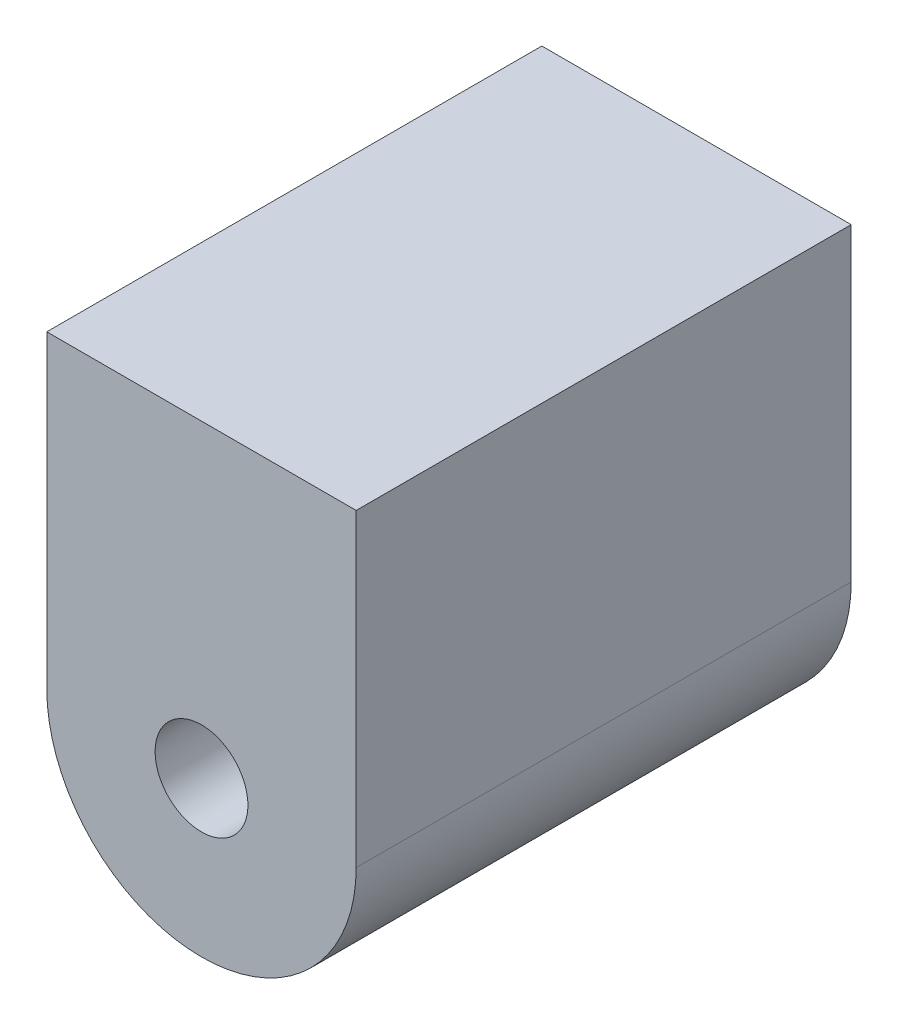
ISO-10303-21;
HEADER;
FILE_DESCRIPTION(('STEP AP214'),'2;1');
FILE_NAME('part.step','',(''),(''),'','','');
FILE_SCHEMA(('AUTOMOTIVE_DESIGN { 1 0 10303 214 1 1 1 1 }'));
ENDSEC;
DATA;
#1=APPLICATION_CONTEXT('core data for automotive mechanical design processes');
#2=APPLICATION_PROTOCOL_DEFINITION('international standard','automotive_design',2000,#1);
#3=PRODUCT_CONTEXT('',#1,'mechanical');
#4=PRODUCT('Part','Part','',(#3));
#5=PRODUCT_RELATED_PRODUCT_CATEGORY('part','',(#4));
#6=PRODUCT_DEFINITION_FORMATION('','',#4);
#7=PRODUCT_DEFINITION_CONTEXT('part definition',#1,'design');
#8=PRODUCT_DEFINITION('design','',#6,#7);
#9=PRODUCT_DEFINITION_SHAPE('','',#8);
#10=(LENGTH_UNIT() NAMED_UNIT(*) SI_UNIT(.MILLI.,.METRE.));
#11=(NAMED_UNIT(*) PLANE_ANGLE_UNIT() SI_UNIT($,.RADIAN.));
#12=(NAMED_UNIT(*) SI_UNIT($,.STERADIAN.) SOLID_ANGLE_UNIT());
#13=UNCERTAINTY_MEASURE_WITH_UNIT(LENGTH_MEASURE(1.E-05),#10,'distance_accuracy_value','');
#14=(GEOMETRIC_REPRESENTATION_CONTEXT(3) GLOBAL_UNCERTAINTY_ASSIGNED_CONTEXT((#13)) GLOBAL_UNIT_ASSIGNED_CONTEXT((#10,
#11,#12)) REPRESENTATION_CONTEXT('',''));
#15=CARTESIAN_POINT('',(0.,0.,0.));
#16=DIRECTION('',(0.,0.,1.));
#17=DIRECTION('',(1.,0.,0.));
#18=AXIS2_PLACEMENT_3D('',#15,#16,#17);
#19=CARTESIAN_POINT('',(31.,-30.,140.));
#20=DIRECTION('',(0.,0.,-1.));
#21=DIRECTION('',(-1.,0.,0.));
#22=AXIS2_PLACEMENT_3D('',#19,#20,#21);
#23=CYLINDRICAL_SURFACE('',#22,5.);
#24=CARTESIAN_POINT('',(31.,-30.,124.));
#25=DIRECTION('',(0.,0.,-1.));
#26=DIRECTION('',(-1.,0.,0.));
#27=AXIS2_PLACEMENT_3D('',#24,#25,#26);
#28=CIRCLE('',#27,5.);
#29=CARTESIAN_POINT('',(36.,-30.,124.));
#30=VERTEX_POINT('',#29);
#31=CARTESIAN_POINT('',(26.,-30.,124.));
#32=VERTEX_POINT('',#31);
#33=EDGE_CURVE('E106',#30,#32,#28,.T.);
#34=ORIENTED_EDGE('',*,*,#33,.F.);
#35=DIRECTION('',(0.,0.,-1.));
#36=VECTOR('',#35,1.);
#37=CARTESIAN_POINT('',(36.,-30.,140.));
#38=LINE('',#37,#36);
#39=CARTESIAN_POINT('',(36.,-30.,140.));
#40=VERTEX_POINT('',#39);
#41=EDGE_CURVE('E11',#40,#30,#38,.T.);
#42=ORIENTED_EDGE('',*,*,#41,.F.);
#43=CARTESIAN_POINT('',(31.,-30.,140.));
#44=DIRECTION('',(0.,0.,-1.));
#45=DIRECTION('',(-1.,0.,0.));
#46=AXIS2_PLACEMENT_3D('',#43,#44,#45);
#47=CIRCLE('',#46,5.);
#48=CARTESIAN_POINT('',(26.,-30.,140.));
#49=VERTEX_POINT('',#48);
#50=EDGE_CURVE('E99',#40,#49,#47,.T.);
#51=ORIENTED_EDGE('',*,*,#50,.T.);
#52=DIRECTION('',(0.,0.,-1.));
#53=VECTOR('',#52,1.);
#54=CARTESIAN_POINT('',(26.,-30.,140.));
#55=LINE('',#54,#53);
#56=EDGE_CURVE('E44',#49,#32,#55,.T.);
#57=ORIENTED_EDGE('',*,*,#56,.T.);
#58=EDGE_LOOP('',(#34,#42,#51,#57));
#59=FACE_BOUND('',#58,.T.);
#60=ADVANCED_FACE('F41',(#59),#23,.T.);
#61=CARTESIAN_POINT('',(36.,-20.,140.));
#62=DIRECTION('',(1.,0.,0.));
#63=DIRECTION('',(0.,0.,-1.));
#64=AXIS2_PLACEMENT_3D('',#61,#62,#63);
#65=PLANE('',#64);
#66=DIRECTION('',(0.,-1.,0.));
#67=VECTOR('',#66,1.);
#68=CARTESIAN_POINT('',(36.,-20.,124.));
#69=LINE('',#68,#67);
#70=CARTESIAN_POINT('',(36.,-20.,124.));
#71=VERTEX_POINT('',#70);
#72=EDGE_CURVE('E101',#71,#30,#69,.T.);
#73=ORIENTED_EDGE('',*,*,#72,.F.);
#74=DIRECTION('',(0.,0.,-1.));
#75=VECTOR('',#74,1.);
#76=CARTESIAN_POINT('',(36.,-20.,140.));
#77=LINE('',#76,#75);
#78=CARTESIAN_POINT('',(36.,-20.,140.));
#79=VERTEX_POINT('',#78);
#80=EDGE_CURVE('E50',#79,#71,#77,.T.);
#81=ORIENTED_EDGE('',*,*,#80,.F.);
#82=DIRECTION('',(0.,-1.,0.));
#83=VECTOR('',#82,1.);
#84=CARTESIAN_POINT('',(36.,-20.,140.));
#85=LINE('',#84,#83);
#86=EDGE_CURVE('E96',#79,#40,#85,.T.);
#87=ORIENTED_EDGE('',*,*,#86,.T.);
#88=ORIENTED_EDGE('',*,*,#41,.T.);
#89=EDGE_LOOP('',(#73,#81,#87,#88));
#90=FACE_BOUND('',#89,.T.);
#91=ADVANCED_FACE('F117',(#90),#65,.T.);
#92=CARTESIAN_POINT('',(36.,-20.,140.));
#93=DIRECTION('',(0.,1.,0.));
#94=DIRECTION('',(0.,0.,1.));
#95=AXIS2_PLACEMENT_3D('',#92,#93,#94);
#96=PLANE('',#95);
#97=DIRECTION('',(1.,0.,0.));
#98=VECTOR('',#97,1.);
#99=CARTESIAN_POINT('',(36.,-20.,124.));
#100=LINE('',#99,#98);
#101=CARTESIAN_POINT('',(26.,-20.,124.));
#102=VERTEX_POINT('',#101);
#103=EDGE_CURVE('E91',#102,#71,#100,.T.);
#104=ORIENTED_EDGE('',*,*,#103,.F.);
#105=DIRECTION('',(0.,0.,-1.));
#106=VECTOR('',#105,1.);
#107=CARTESIAN_POINT('',(26.,-20.,140.));
#108=LINE('',#107,#106);
#109=CARTESIAN_POINT('',(26.,-20.,140.));
#110=VERTEX_POINT('',#109);
#111=EDGE_CURVE('E86',#110,#102,#108,.T.);
#112=ORIENTED_EDGE('',*,*,#111,.F.);
#113=DIRECTION('',(1.,0.,0.));
#114=VECTOR('',#113,1.);
#115=CARTESIAN_POINT('',(36.,-20.,140.));
#116=LINE('',#115,#114);
#117=EDGE_CURVE('E89',#110,#79,#116,.T.);
#118=ORIENTED_EDGE('',*,*,#117,.T.);
#119=ORIENTED_EDGE('',*,*,#80,.T.);
#120=EDGE_LOOP('',(#104,#112,#118,#119));
#121=FACE_BOUND('',#120,.T.);
#122=ADVANCED_FACE('F88',(#121),#96,.T.);
#123=CARTESIAN_POINT('',(26.,-20.,140.));
#124=DIRECTION('',(-1.,0.,0.));
#125=DIRECTION('',(0.,0.,1.));
#126=AXIS2_PLACEMENT_3D('',#123,#124,#125);
#127=PLANE('',#126);
#128=DIRECTION('',(0.,1.,0.));
#129=VECTOR('',#128,1.);
#130=CARTESIAN_POINT('',(26.,-20.,124.));
#131=LINE('',#130,#129);
#132=EDGE_CURVE('E109',#32,#102,#131,.T.);
#133=ORIENTED_EDGE('',*,*,#132,.F.);
#134=ORIENTED_EDGE('',*,*,#56,.F.);
#135=DIRECTION('',(0.,1.,0.));
#136=VECTOR('',#135,1.);
#137=CARTESIAN_POINT('',(26.,-20.,140.));
#138=LINE('',#137,#136);
#139=EDGE_CURVE('E95',#49,#110,#138,.T.);
#140=ORIENTED_EDGE('',*,*,#139,.T.);
#141=ORIENTED_EDGE('',*,*,#111,.T.);
#142=EDGE_LOOP('',(#133,#134,#140,#141));
#143=FACE_BOUND('',#142,.T.);
#144=ADVANCED_FACE('F98',(#143),#127,.T.);
#145=CARTESIAN_POINT('',(31.,-30.,140.));
#146=DIRECTION('',(0.,0.,-1.));
#147=DIRECTION('',(-1.,0.,0.));
#148=AXIS2_PLACEMENT_3D('',#145,#146,#147);
#149=PLANE('',#148);
#150=CARTESIAN_POINT('',(31.,-30.,140.));
#151=DIRECTION('',(0.,0.,-1.));
#152=DIRECTION('',(-1.,0.,0.));
#153=AXIS2_PLACEMENT_3D('',#150,#151,#152);
#154=CIRCLE('',#153,1.49999999999979);
#155=CARTESIAN_POINT('',(29.5000000000002,-30.,140.));
#156=VERTEX_POINT('',#155);
#157=EDGE_CURVE('E110',#156,#156,#154,.T.);
#158=ORIENTED_EDGE('',*,*,#157,.T.);
#159=EDGE_LOOP('',(#158));
#160=FACE_BOUND('',#159,.T.);
#161=ORIENTED_EDGE('',*,*,#50,.F.);
#162=ORIENTED_EDGE('',*,*,#86,.F.);
#163=ORIENTED_EDGE('',*,*,#117,.F.);
#164=ORIENTED_EDGE('',*,*,#139,.F.);
#165=EDGE_LOOP('',(#161,#162,#163,#164));
#166=FACE_BOUND('',#165,.T.);
#167=ADVANCED_FACE('F94',(#160,#166),#149,.F.);
#168=CARTESIAN_POINT('',(31.,-30.,124.));
#169=DIRECTION('',(0.,0.,-1.));
#170=DIRECTION('',(-1.,0.,0.));
#171=AXIS2_PLACEMENT_3D('',#168,#169,#170);
#172=PLANE('',#171);
#173=CARTESIAN_POINT('',(31.,-30.,124.));
#174=DIRECTION('',(0.,0.,-1.));
#175=DIRECTION('',(-1.,0.,0.));
#176=AXIS2_PLACEMENT_3D('',#173,#174,#175);
#177=CIRCLE('',#176,1.49999999999979);
#178=CARTESIAN_POINT('',(29.5000000000002,-30.,124.));
#179=VERTEX_POINT('',#178);
#180=EDGE_CURVE('E151',#179,#179,#177,.T.);
#181=ORIENTED_EDGE('',*,*,#180,.F.);
#182=EDGE_LOOP('',(#181));
#183=FACE_BOUND('',#182,.T.);
#184=ORIENTED_EDGE('',*,*,#33,.T.);
#185=ORIENTED_EDGE('',*,*,#132,.T.);
#186=ORIENTED_EDGE('',*,*,#103,.T.);
#187=ORIENTED_EDGE('',*,*,#72,.T.);
#188=EDGE_LOOP('',(#184,#185,#186,#187));
#189=FACE_BOUND('',#188,.T.);
#190=ADVANCED_FACE('F116',(#183,#189),#172,.T.);
#191=CARTESIAN_POINT('',(31.,-30.,140.));
#192=DIRECTION('',(0.,0.,-1.));
#193=DIRECTION('',(-1.,0.,0.));
#194=AXIS2_PLACEMENT_3D('',#191,#192,#193);
#195=CYLINDRICAL_SURFACE('',#194,1.49999999999979);
#196=ORIENTED_EDGE('',*,*,#157,.F.);
#197=EDGE_LOOP('',(#196));
#198=FACE_BOUND('',#197,.T.);
#199=ORIENTED_EDGE('',*,*,#180,.T.);
#200=EDGE_LOOP('',(#199));
#201=FACE_BOUND('',#200,.T.);
#202=ADVANCED_FACE('F138',(#198,#201),#195,.F.);
#203=CLOSED_SHELL('',(#60,#91,#122,#144,#167,#190,#202));
#204=MANIFOLD_SOLID_BREP('B2',#203);
#205=ADVANCED_BREP_SHAPE_REPRESENTATION('',(#18,#204),#14);
#206=SHAPE_DEFINITION_REPRESENTATION(#9,#205);
ENDSEC;
END-ISO-10303-21;
